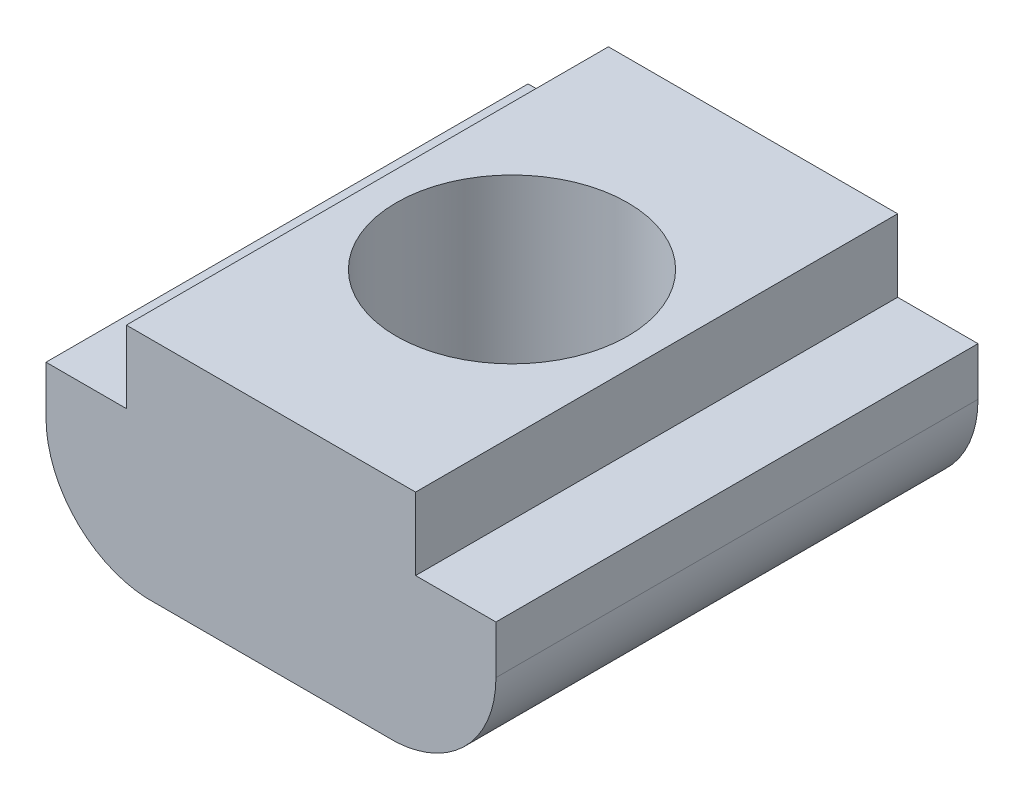
ISO-10303-21;
HEADER;
FILE_DESCRIPTION(('STEP AP214'),'2;1');
FILE_NAME('part.step','',(''),(''),'','','');
FILE_SCHEMA(('AUTOMOTIVE_DESIGN { 1 0 10303 214 1 1 1 1 }'));
ENDSEC;
DATA;
#1=APPLICATION_CONTEXT('core data for automotive mechanical design processes');
#2=APPLICATION_PROTOCOL_DEFINITION('international standard','automotive_design',2000,#1);
#3=PRODUCT_CONTEXT('',#1,'mechanical');
#4=PRODUCT('Part','Part','',(#3));
#5=PRODUCT_RELATED_PRODUCT_CATEGORY('part','',(#4));
#6=PRODUCT_DEFINITION_FORMATION('','',#4);
#7=PRODUCT_DEFINITION_CONTEXT('part definition',#1,'design');
#8=PRODUCT_DEFINITION('design','',#6,#7);
#9=PRODUCT_DEFINITION_SHAPE('','',#8);
#10=(LENGTH_UNIT() NAMED_UNIT(*) SI_UNIT(.MILLI.,.METRE.));
#11=(NAMED_UNIT(*) PLANE_ANGLE_UNIT() SI_UNIT($,.RADIAN.));
#12=(NAMED_UNIT(*) SI_UNIT($,.STERADIAN.) SOLID_ANGLE_UNIT());
#13=UNCERTAINTY_MEASURE_WITH_UNIT(LENGTH_MEASURE(1.E-05),#10,'distance_accuracy_value','');
#14=(GEOMETRIC_REPRESENTATION_CONTEXT(3) GLOBAL_UNCERTAINTY_ASSIGNED_CONTEXT((#13)) GLOBAL_UNIT_ASSIGNED_CONTEXT((#10,
#11,#12)) REPRESENTATION_CONTEXT('',''));
#15=CARTESIAN_POINT('',(0.,0.,0.));
#16=DIRECTION('',(0.,0.,1.));
#17=DIRECTION('',(1.,0.,0.));
#18=AXIS2_PLACEMENT_3D('',#15,#16,#17);
#19=CARTESIAN_POINT('',(2.99999999999999,3.00000000000002,5.));
#20=DIRECTION('',(-1.,0.,0.));
#21=DIRECTION('',(0.,-1.,0.));
#22=AXIS2_PLACEMENT_3D('',#19,#20,#21);
#23=PLANE('',#22);
#24=DIRECTION('',(0.,1.,0.));
#25=VECTOR('',#24,1.);
#26=CARTESIAN_POINT('',(2.99999999999999,3.00000000000002,-5.));
#27=LINE('',#26,#25);
#28=CARTESIAN_POINT('',(3.,1.50000000000002,-5.));
#29=VERTEX_POINT('',#28);
#30=CARTESIAN_POINT('',(2.99999999999999,3.00000000000002,-5.));
#31=VERTEX_POINT('',#30);
#32=EDGE_CURVE('E142',#29,#31,#27,.T.);
#33=ORIENTED_EDGE('',*,*,#32,.T.);
#34=DIRECTION('',(0.,0.,-1.));
#35=VECTOR('',#34,1.);
#36=CARTESIAN_POINT('',(2.99999999999999,3.00000000000002,5.));
#37=LINE('',#36,#35);
#38=CARTESIAN_POINT('',(2.99999999999999,3.00000000000002,5.));
#39=VERTEX_POINT('',#38);
#40=EDGE_CURVE('E11',#39,#31,#37,.T.);
#41=ORIENTED_EDGE('',*,*,#40,.F.);
#42=DIRECTION('',(0.,1.,0.));
#43=VECTOR('',#42,1.);
#44=CARTESIAN_POINT('',(2.99999999999999,3.00000000000002,5.));
#45=LINE('',#44,#43);
#46=CARTESIAN_POINT('',(3.,1.50000000000002,5.));
#47=VERTEX_POINT('',#46);
#48=EDGE_CURVE('E161',#47,#39,#45,.T.);
#49=ORIENTED_EDGE('',*,*,#48,.F.);
#50=DIRECTION('',(0.,0.,-1.));
#51=VECTOR('',#50,1.);
#52=CARTESIAN_POINT('',(3.,1.50000000000002,5.));
#53=LINE('',#52,#51);
#54=EDGE_CURVE('E138',#47,#29,#53,.T.);
#55=ORIENTED_EDGE('',*,*,#54,.T.);
#56=EDGE_LOOP('',(#33,#41,#49,#55));
#57=FACE_BOUND('',#56,.T.);
#58=ADVANCED_FACE('F34',(#57),#23,.F.);
#59=CARTESIAN_POINT('',(2.99999999999999,3.00000000000002,5.));
#60=DIRECTION('',(0.,-1.,0.));
#61=DIRECTION('',(1.,0.,0.));
#62=AXIS2_PLACEMENT_3D('',#59,#60,#61);
#63=PLANE('',#62);
#64=CARTESIAN_POINT('',(0.,3.,0.));
#65=DIRECTION('',(0.,1.,0.));
#66=DIRECTION('',(0.,0.,1.));
#67=AXIS2_PLACEMENT_3D('',#64,#65,#66);
#68=CIRCLE('',#67,2.4);
#69=CARTESIAN_POINT('',(0.,3.,2.4));
#70=VERTEX_POINT('',#69);
#71=EDGE_CURVE('E210',#70,#70,#68,.T.);
#72=ORIENTED_EDGE('',*,*,#71,.F.);
#73=EDGE_LOOP('',(#72));
#74=FACE_BOUND('',#73,.T.);
#75=DIRECTION('',(-1.,0.,0.));
#76=VECTOR('',#75,1.);
#77=CARTESIAN_POINT('',(2.99999999999999,3.00000000000002,-5.));
#78=LINE('',#77,#76);
#79=CARTESIAN_POINT('',(-3.00000000000001,2.99999999999998,-5.));
#80=VERTEX_POINT('',#79);
#81=EDGE_CURVE('E145',#31,#80,#78,.T.);
#82=ORIENTED_EDGE('',*,*,#81,.T.);
#83=DIRECTION('',(0.,0.,-1.));
#84=VECTOR('',#83,1.);
#85=CARTESIAN_POINT('',(-3.00000000000001,2.99999999999998,5.));
#86=LINE('',#85,#84);
#87=CARTESIAN_POINT('',(-3.00000000000001,2.99999999999998,5.));
#88=VERTEX_POINT('',#87);
#89=EDGE_CURVE('E42',#88,#80,#86,.T.);
#90=ORIENTED_EDGE('',*,*,#89,.F.);
#91=DIRECTION('',(-1.,0.,0.));
#92=VECTOR('',#91,1.);
#93=CARTESIAN_POINT('',(2.99999999999999,3.00000000000002,5.));
#94=LINE('',#93,#92);
#95=EDGE_CURVE('E99',#39,#88,#94,.T.);
#96=ORIENTED_EDGE('',*,*,#95,.F.);
#97=ORIENTED_EDGE('',*,*,#40,.T.);
#98=EDGE_LOOP('',(#82,#90,#96,#97));
#99=FACE_BOUND('',#98,.T.);
#100=ADVANCED_FACE('F216',(#74,#99),#63,.F.);
#101=CARTESIAN_POINT('',(-3.00000000000001,2.99999999999998,5.));
#102=DIRECTION('',(1.,0.,0.));
#103=DIRECTION('',(0.,1.,0.));
#104=AXIS2_PLACEMENT_3D('',#101,#102,#103);
#105=PLANE('',#104);
#106=DIRECTION('',(0.,-1.,0.));
#107=VECTOR('',#106,1.);
#108=CARTESIAN_POINT('',(-3.00000000000001,2.99999999999998,-5.));
#109=LINE('',#108,#107);
#110=CARTESIAN_POINT('',(-3.,1.49999999999998,-5.));
#111=VERTEX_POINT('',#110);
#112=EDGE_CURVE('E148',#80,#111,#109,.T.);
#113=ORIENTED_EDGE('',*,*,#112,.T.);
#114=DIRECTION('',(0.,0.,-1.));
#115=VECTOR('',#114,1.);
#116=CARTESIAN_POINT('',(-3.,1.49999999999998,5.));
#117=LINE('',#116,#115);
#118=CARTESIAN_POINT('',(-3.,1.49999999999998,5.));
#119=VERTEX_POINT('',#118);
#120=EDGE_CURVE('E174',#119,#111,#117,.T.);
#121=ORIENTED_EDGE('',*,*,#120,.F.);
#122=DIRECTION('',(0.,-1.,0.));
#123=VECTOR('',#122,1.);
#124=CARTESIAN_POINT('',(-3.00000000000001,2.99999999999998,5.));
#125=LINE('',#124,#123);
#126=EDGE_CURVE('E182',#88,#119,#125,.T.);
#127=ORIENTED_EDGE('',*,*,#126,.F.);
#128=ORIENTED_EDGE('',*,*,#89,.T.);
#129=EDGE_LOOP('',(#113,#121,#127,#128));
#130=FACE_BOUND('',#129,.T.);
#131=ADVANCED_FACE('F180',(#130),#105,.F.);
#132=CARTESIAN_POINT('',(-3.,1.49999999999998,5.));
#133=DIRECTION('',(0.,-1.,0.));
#134=DIRECTION('',(1.,0.,0.));
#135=AXIS2_PLACEMENT_3D('',#132,#133,#134);
#136=PLANE('',#135);
#137=DIRECTION('',(-1.,0.,0.));
#138=VECTOR('',#137,1.);
#139=CARTESIAN_POINT('',(-3.,1.49999999999998,-5.));
#140=LINE('',#139,#138);
#141=CARTESIAN_POINT('',(-4.6667467312933,1.49999999999997,-5.));
#142=VERTEX_POINT('',#141);
#143=EDGE_CURVE('E150',#111,#142,#140,.T.);
#144=ORIENTED_EDGE('',*,*,#143,.T.);
#145=DIRECTION('',(0.,0.,-1.));
#146=VECTOR('',#145,1.);
#147=CARTESIAN_POINT('',(-4.6667467312933,1.49999999999997,5.));
#148=LINE('',#147,#146);
#149=CARTESIAN_POINT('',(-4.6667467312933,1.49999999999997,5.));
#150=VERTEX_POINT('',#149);
#151=EDGE_CURVE('E171',#150,#142,#148,.T.);
#152=ORIENTED_EDGE('',*,*,#151,.F.);
#153=DIRECTION('',(-1.,0.,0.));
#154=VECTOR('',#153,1.);
#155=CARTESIAN_POINT('',(-3.,1.49999999999998,5.));
#156=LINE('',#155,#154);
#157=EDGE_CURVE('E200',#119,#150,#156,.T.);
#158=ORIENTED_EDGE('',*,*,#157,.F.);
#159=ORIENTED_EDGE('',*,*,#120,.T.);
#160=EDGE_LOOP('',(#144,#152,#158,#159));
#161=FACE_BOUND('',#160,.T.);
#162=ADVANCED_FACE('F191',(#161),#136,.F.);
#163=CARTESIAN_POINT('',(-4.6667467312933,1.49999999999997,5.));
#164=DIRECTION('',(1.,0.,0.));
#165=DIRECTION('',(0.,1.,0.));
#166=AXIS2_PLACEMENT_3D('',#163,#164,#165);
#167=PLANE('',#166);
#168=DIRECTION('',(0.,-1.,0.));
#169=VECTOR('',#168,1.);
#170=CARTESIAN_POINT('',(-4.6667467312933,1.49999999999997,-5.));
#171=LINE('',#170,#169);
#172=CARTESIAN_POINT('',(-4.66674673129329,0.499999999999967,-5.));
#173=VERTEX_POINT('',#172);
#174=EDGE_CURVE('E152',#142,#173,#171,.T.);
#175=ORIENTED_EDGE('',*,*,#174,.T.);
#176=DIRECTION('',(0.,0.,-1.));
#177=VECTOR('',#176,1.);
#178=CARTESIAN_POINT('',(-4.66674673129329,0.499999999999967,5.));
#179=LINE('',#178,#177);
#180=CARTESIAN_POINT('',(-4.66674673129329,0.499999999999967,5.));
#181=VERTEX_POINT('',#180);
#182=EDGE_CURVE('E168',#181,#173,#179,.T.);
#183=ORIENTED_EDGE('',*,*,#182,.F.);
#184=DIRECTION('',(0.,-1.,0.));
#185=VECTOR('',#184,1.);
#186=CARTESIAN_POINT('',(-4.6667467312933,1.49999999999997,5.));
#187=LINE('',#186,#185);
#188=EDGE_CURVE('E197',#150,#181,#187,.T.);
#189=ORIENTED_EDGE('',*,*,#188,.F.);
#190=ORIENTED_EDGE('',*,*,#151,.T.);
#191=EDGE_LOOP('',(#175,#183,#189,#190));
#192=FACE_BOUND('',#191,.T.);
#193=ADVANCED_FACE('F195',(#192),#167,.F.);
#194=CARTESIAN_POINT('',(-2.46907071737372,0.499999999999982,5.));
#195=DIRECTION('',(0.,0.,-1.));
#196=DIRECTION('',(-1.,0.,0.));
#197=AXIS2_PLACEMENT_3D('',#194,#195,#196);
#198=CYLINDRICAL_SURFACE('',#197,2.19767601391957);
#199=CARTESIAN_POINT('',(-2.46907071737372,0.499999999999982,-5.));
#200=DIRECTION('',(0.,0.,1.));
#201=DIRECTION('',(1.,0.,0.));
#202=AXIS2_PLACEMENT_3D('',#199,#200,#201);
#203=CIRCLE('',#202,2.19767601391957);
#204=CARTESIAN_POINT('',(-2.60000000000001,-1.69377240959687,-5.));
#205=VERTEX_POINT('',#204);
#206=EDGE_CURVE('E154',#173,#205,#203,.T.);
#207=ORIENTED_EDGE('',*,*,#206,.T.);
#208=DIRECTION('',(0.,0.,-1.));
#209=VECTOR('',#208,1.);
#210=CARTESIAN_POINT('',(-2.60000000000001,-1.69377240959687,5.));
#211=LINE('',#210,#209);
#212=CARTESIAN_POINT('',(-2.60000000000001,-1.69377240959687,5.));
#213=VERTEX_POINT('',#212);
#214=EDGE_CURVE('E165',#213,#205,#211,.T.);
#215=ORIENTED_EDGE('',*,*,#214,.F.);
#216=CARTESIAN_POINT('',(-2.46907071737372,0.499999999999982,5.));
#217=DIRECTION('',(0.,0.,1.));
#218=DIRECTION('',(1.,0.,0.));
#219=AXIS2_PLACEMENT_3D('',#216,#217,#218);
#220=CIRCLE('',#219,2.19767601391957);
#221=EDGE_CURVE('E199',#181,#213,#220,.T.);
#222=ORIENTED_EDGE('',*,*,#221,.F.);
#223=ORIENTED_EDGE('',*,*,#182,.T.);
#224=EDGE_LOOP('',(#207,#215,#222,#223));
#225=FACE_BOUND('',#224,.T.);
#226=ADVANCED_FACE('F226',(#225),#198,.T.);
#227=CARTESIAN_POINT('',(2.60000000000006,-1.69377240959683,5.));
#228=DIRECTION('',(0.,1.,0.));
#229=DIRECTION('',(-1.,0.,0.));
#230=AXIS2_PLACEMENT_3D('',#227,#228,#229);
#231=PLANE('',#230);
#232=CARTESIAN_POINT('',(0.,-1.6937724095969,0.));
#233=DIRECTION('',(0.,1.,0.));
#234=DIRECTION('',(0.,0.,1.));
#235=AXIS2_PLACEMENT_3D('',#232,#233,#234);
#236=CIRCLE('',#235,2.4);
#237=CARTESIAN_POINT('',(0.,-1.6937724095969,2.4));
#238=VERTEX_POINT('',#237);
#239=EDGE_CURVE('E146',#238,#238,#236,.T.);
#240=ORIENTED_EDGE('',*,*,#239,.T.);
#241=EDGE_LOOP('',(#240));
#242=FACE_BOUND('',#241,.T.);
#243=DIRECTION('',(1.,0.,0.));
#244=VECTOR('',#243,1.);
#245=CARTESIAN_POINT('',(2.60000000000006,-1.69377240959683,-5.));
#246=LINE('',#245,#244);
#247=CARTESIAN_POINT('',(2.60000000000006,-1.69377240959683,-5.));
#248=VERTEX_POINT('',#247);
#249=EDGE_CURVE('E156',#205,#248,#246,.T.);
#250=ORIENTED_EDGE('',*,*,#249,.T.);
#251=DIRECTION('',(0.,0.,-1.));
#252=VECTOR('',#251,1.);
#253=CARTESIAN_POINT('',(2.60000000000006,-1.69377240959683,5.));
#254=LINE('',#253,#252);
#255=CARTESIAN_POINT('',(2.60000000000006,-1.69377240959683,5.));
#256=VERTEX_POINT('',#255);
#257=EDGE_CURVE('E133',#256,#248,#254,.T.);
#258=ORIENTED_EDGE('',*,*,#257,.F.);
#259=DIRECTION('',(1.,0.,0.));
#260=VECTOR('',#259,1.);
#261=CARTESIAN_POINT('',(2.60000000000006,-1.69377240959683,5.));
#262=LINE('',#261,#260);
#263=EDGE_CURVE('E124',#213,#256,#262,.T.);
#264=ORIENTED_EDGE('',*,*,#263,.F.);
#265=ORIENTED_EDGE('',*,*,#214,.T.);
#266=EDGE_LOOP('',(#250,#258,#264,#265));
#267=FACE_BOUND('',#266,.T.);
#268=ADVANCED_FACE('F223',(#242,#267),#231,.F.);
#269=CARTESIAN_POINT('',(2.46907071737373,0.500000000000017,5.));
#270=DIRECTION('',(0.,0.,-1.));
#271=DIRECTION('',(-1.,0.,0.));
#272=AXIS2_PLACEMENT_3D('',#269,#270,#271);
#273=CYLINDRICAL_SURFACE('',#272,2.19767601391957);
#274=CARTESIAN_POINT('',(2.46907071737373,0.500000000000017,-5.));
#275=DIRECTION('',(0.,0.,1.));
#276=DIRECTION('',(-1.,0.,0.));
#277=AXIS2_PLACEMENT_3D('',#274,#275,#276);
#278=CIRCLE('',#277,2.19767601391957);
#279=CARTESIAN_POINT('',(4.6667467312933,0.500000000000033,-5.));
#280=VERTEX_POINT('',#279);
#281=EDGE_CURVE('E132',#248,#280,#278,.T.);
#282=ORIENTED_EDGE('',*,*,#281,.T.);
#283=DIRECTION('',(0.,0.,-1.));
#284=VECTOR('',#283,1.);
#285=CARTESIAN_POINT('',(4.6667467312933,0.500000000000033,5.));
#286=LINE('',#285,#284);
#287=CARTESIAN_POINT('',(4.6667467312933,0.500000000000033,5.));
#288=VERTEX_POINT('',#287);
#289=EDGE_CURVE('E129',#288,#280,#286,.T.);
#290=ORIENTED_EDGE('',*,*,#289,.F.);
#291=CARTESIAN_POINT('',(2.46907071737373,0.500000000000017,5.));
#292=DIRECTION('',(0.,0.,1.));
#293=DIRECTION('',(-1.,0.,0.));
#294=AXIS2_PLACEMENT_3D('',#291,#292,#293);
#295=CIRCLE('',#294,2.19767601391957);
#296=EDGE_CURVE('E118',#256,#288,#295,.T.);
#297=ORIENTED_EDGE('',*,*,#296,.F.);
#298=ORIENTED_EDGE('',*,*,#257,.T.);
#299=EDGE_LOOP('',(#282,#290,#297,#298));
#300=FACE_BOUND('',#299,.T.);
#301=ADVANCED_FACE('F130',(#300),#273,.T.);
#302=CARTESIAN_POINT('',(4.6667467312933,1.50000000000003,5.));
#303=DIRECTION('',(-1.,0.,0.));
#304=DIRECTION('',(0.,-1.,0.));
#305=AXIS2_PLACEMENT_3D('',#302,#303,#304);
#306=PLANE('',#305);
#307=DIRECTION('',(0.,1.,0.));
#308=VECTOR('',#307,1.);
#309=CARTESIAN_POINT('',(4.6667467312933,1.50000000000003,-5.));
#310=LINE('',#309,#308);
#311=CARTESIAN_POINT('',(4.6667467312933,1.50000000000003,-5.));
#312=VERTEX_POINT('',#311);
#313=EDGE_CURVE('E85',#280,#312,#310,.T.);
#314=ORIENTED_EDGE('',*,*,#313,.T.);
#315=DIRECTION('',(0.,0.,-1.));
#316=VECTOR('',#315,1.);
#317=CARTESIAN_POINT('',(4.6667467312933,1.50000000000003,5.));
#318=LINE('',#317,#316);
#319=CARTESIAN_POINT('',(4.6667467312933,1.50000000000003,5.));
#320=VERTEX_POINT('',#319);
#321=EDGE_CURVE('E134',#320,#312,#318,.T.);
#322=ORIENTED_EDGE('',*,*,#321,.F.);
#323=DIRECTION('',(0.,1.,0.));
#324=VECTOR('',#323,1.);
#325=CARTESIAN_POINT('',(4.6667467312933,1.50000000000003,5.));
#326=LINE('',#325,#324);
#327=EDGE_CURVE('E122',#288,#320,#326,.T.);
#328=ORIENTED_EDGE('',*,*,#327,.F.);
#329=ORIENTED_EDGE('',*,*,#289,.T.);
#330=EDGE_LOOP('',(#314,#322,#328,#329));
#331=FACE_BOUND('',#330,.T.);
#332=ADVANCED_FACE('F136',(#331),#306,.F.);
#333=CARTESIAN_POINT('',(3.,1.50000000000002,5.));
#334=DIRECTION('',(0.,-1.,0.));
#335=DIRECTION('',(1.,0.,0.));
#336=AXIS2_PLACEMENT_3D('',#333,#334,#335);
#337=PLANE('',#336);
#338=DIRECTION('',(-1.,0.,0.));
#339=VECTOR('',#338,1.);
#340=CARTESIAN_POINT('',(3.,1.50000000000002,-5.));
#341=LINE('',#340,#339);
#342=EDGE_CURVE('E91',#312,#29,#341,.T.);
#343=ORIENTED_EDGE('',*,*,#342,.T.);
#344=ORIENTED_EDGE('',*,*,#54,.F.);
#345=DIRECTION('',(-1.,0.,0.));
#346=VECTOR('',#345,1.);
#347=CARTESIAN_POINT('',(3.,1.50000000000002,5.));
#348=LINE('',#347,#346);
#349=EDGE_CURVE('E50',#320,#47,#348,.T.);
#350=ORIENTED_EDGE('',*,*,#349,.F.);
#351=ORIENTED_EDGE('',*,*,#321,.T.);
#352=EDGE_LOOP('',(#343,#344,#350,#351));
#353=FACE_BOUND('',#352,.T.);
#354=ADVANCED_FACE('F288',(#353),#337,.F.);
#355=CARTESIAN_POINT('',(2.46907071737373,0.500000000000017,5.));
#356=DIRECTION('',(0.,0.,-1.));
#357=DIRECTION('',(-1.,0.,0.));
#358=AXIS2_PLACEMENT_3D('',#355,#356,#357);
#359=PLANE('',#358);
#360=ORIENTED_EDGE('',*,*,#48,.T.);
#361=ORIENTED_EDGE('',*,*,#95,.T.);
#362=ORIENTED_EDGE('',*,*,#126,.T.);
#363=ORIENTED_EDGE('',*,*,#157,.T.);
#364=ORIENTED_EDGE('',*,*,#188,.T.);
#365=ORIENTED_EDGE('',*,*,#221,.T.);
#366=ORIENTED_EDGE('',*,*,#263,.T.);
#367=ORIENTED_EDGE('',*,*,#296,.T.);
#368=ORIENTED_EDGE('',*,*,#327,.T.);
#369=ORIENTED_EDGE('',*,*,#349,.T.);
#370=EDGE_LOOP('',(#360,#361,#362,#363,#364,#365,#366,#367,#368,#369));
#371=FACE_BOUND('',#370,.T.);
#372=ADVANCED_FACE('F120',(#371),#359,.F.);
#373=CARTESIAN_POINT('',(2.46907071737373,0.500000000000017,-5.));
#374=DIRECTION('',(0.,0.,-1.));
#375=DIRECTION('',(-1.,0.,0.));
#376=AXIS2_PLACEMENT_3D('',#373,#374,#375);
#377=PLANE('',#376);
#378=ORIENTED_EDGE('',*,*,#32,.F.);
#379=ORIENTED_EDGE('',*,*,#342,.F.);
#380=ORIENTED_EDGE('',*,*,#313,.F.);
#381=ORIENTED_EDGE('',*,*,#281,.F.);
#382=ORIENTED_EDGE('',*,*,#249,.F.);
#383=ORIENTED_EDGE('',*,*,#206,.F.);
#384=ORIENTED_EDGE('',*,*,#174,.F.);
#385=ORIENTED_EDGE('',*,*,#143,.F.);
#386=ORIENTED_EDGE('',*,*,#112,.F.);
#387=ORIENTED_EDGE('',*,*,#81,.F.);
#388=EDGE_LOOP('',(#378,#379,#380,#381,#382,#383,#384,#385,#386,#387));
#389=FACE_BOUND('',#388,.T.);
#390=ADVANCED_FACE('F186',(#389),#377,.T.);
#391=CARTESIAN_POINT('',(0.,3.,0.));
#392=DIRECTION('',(0.,1.,0.));
#393=DIRECTION('',(0.,0.,1.));
#394=AXIS2_PLACEMENT_3D('',#391,#392,#393);
#395=CYLINDRICAL_SURFACE('',#394,2.4);
#396=ORIENTED_EDGE('',*,*,#239,.F.);
#397=EDGE_LOOP('',(#396));
#398=FACE_BOUND('',#397,.T.);
#399=ORIENTED_EDGE('',*,*,#71,.T.);
#400=EDGE_LOOP('',(#399));
#401=FACE_BOUND('',#400,.T.);
#402=ADVANCED_FACE('F214',(#398,#401),#395,.F.);
#403=CLOSED_SHELL('',(#58,#100,#131,#162,#193,#226,#268,#301,#332,#354,#372,#390,#402));
#404=MANIFOLD_SOLID_BREP('B2',#403);
#405=ADVANCED_BREP_SHAPE_REPRESENTATION('',(#18,#404),#14);
#406=SHAPE_DEFINITION_REPRESENTATION(#9,#405);
ENDSEC;
END-ISO-10303-21;
